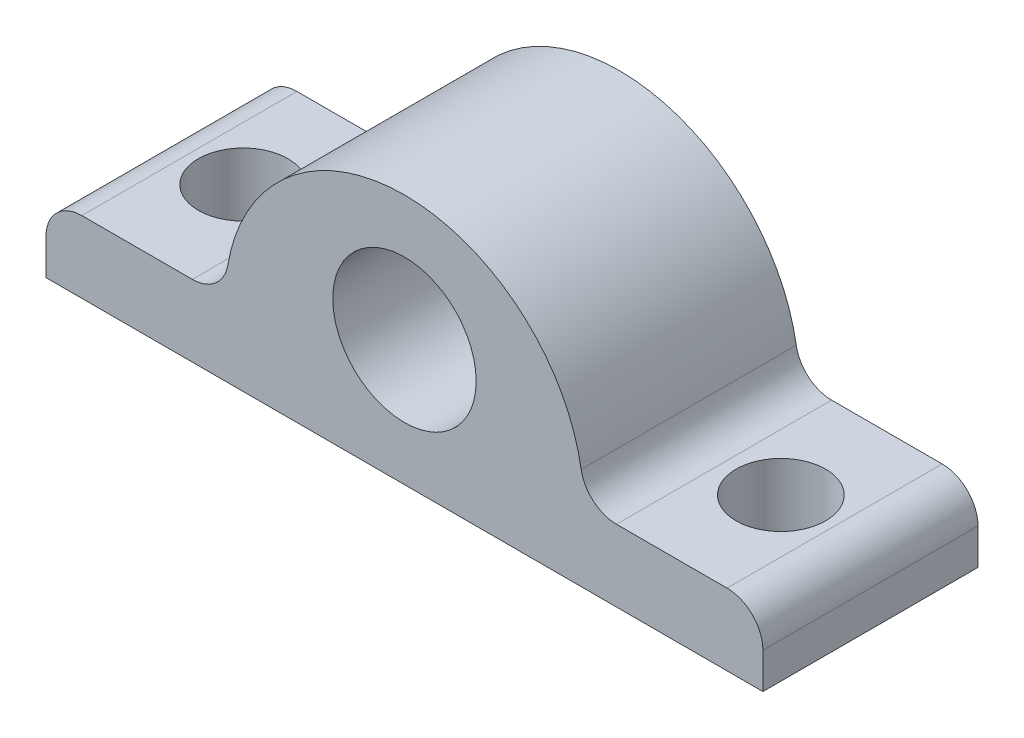
ISO-10303-21;
HEADER;
FILE_DESCRIPTION(('STEP AP214'),'2;1');
FILE_NAME('part.step','',(''),(''),'','','');
FILE_SCHEMA(('AUTOMOTIVE_DESIGN { 1 0 10303 214 1 1 1 1 }'));
ENDSEC;
DATA;
#1=APPLICATION_CONTEXT('core data for automotive mechanical design processes');
#2=APPLICATION_PROTOCOL_DEFINITION('international standard','automotive_design',2000,#1);
#3=PRODUCT_CONTEXT('',#1,'mechanical');
#4=PRODUCT('Part','Part','',(#3));
#5=PRODUCT_RELATED_PRODUCT_CATEGORY('part','',(#4));
#6=PRODUCT_DEFINITION_FORMATION('','',#4);
#7=PRODUCT_DEFINITION_CONTEXT('part definition',#1,'design');
#8=PRODUCT_DEFINITION('design','',#6,#7);
#9=PRODUCT_DEFINITION_SHAPE('','',#8);
#10=(LENGTH_UNIT() NAMED_UNIT(*) SI_UNIT(.MILLI.,.METRE.));
#11=(NAMED_UNIT(*) PLANE_ANGLE_UNIT() SI_UNIT($,.RADIAN.));
#12=(NAMED_UNIT(*) SI_UNIT($,.STERADIAN.) SOLID_ANGLE_UNIT());
#13=UNCERTAINTY_MEASURE_WITH_UNIT(LENGTH_MEASURE(1.E-05),#10,'distance_accuracy_value','');
#14=(GEOMETRIC_REPRESENTATION_CONTEXT(3) GLOBAL_UNCERTAINTY_ASSIGNED_CONTEXT((#13)) GLOBAL_UNIT_ASSIGNED_CONTEXT((#10,
#11,#12)) REPRESENTATION_CONTEXT('',''));
#15=CARTESIAN_POINT('',(0.,0.,0.));
#16=DIRECTION('',(0.,0.,1.));
#17=DIRECTION('',(1.,0.,0.));
#18=AXIS2_PLACEMENT_3D('',#15,#16,#17);
#19=CARTESIAN_POINT('',(0.,4.,0.));
#20=DIRECTION('',(0.,1.,0.));
#21=DIRECTION('',(0.,0.,1.));
#22=AXIS2_PLACEMENT_3D('',#19,#20,#21);
#23=PLANE('',#22);
#24=CARTESIAN_POINT('',(-15.,4.,0.));
#25=DIRECTION('',(0.,1.,0.));
#26=DIRECTION('',(0.,0.,1.));
#27=AXIS2_PLACEMENT_3D('',#24,#25,#26);
#28=CIRCLE('',#27,2.5);
#29=CARTESIAN_POINT('',(-15.,4.,2.5));
#30=VERTEX_POINT('',#29);
#31=EDGE_CURVE('E220',#30,#30,#28,.T.);
#32=ORIENTED_EDGE('',*,*,#31,.F.);
#33=EDGE_LOOP('',(#32));
#34=FACE_BOUND('',#33,.T.);
#35=DIRECTION('',(1.,0.,0.));
#36=VECTOR('',#35,1.);
#37=CARTESIAN_POINT('',(-20.,4.,6.));
#38=LINE('',#37,#36);
#39=CARTESIAN_POINT('',(-18.,4.,6.));
#40=VERTEX_POINT('',#39);
#41=CARTESIAN_POINT('',(-11.8321595661992,4.,6.));
#42=VERTEX_POINT('',#41);
#43=EDGE_CURVE('E138',#40,#42,#38,.T.);
#44=ORIENTED_EDGE('',*,*,#43,.T.);
#45=DIRECTION('',(0.,0.,-1.));
#46=VECTOR('',#45,1.);
#47=CARTESIAN_POINT('',(-11.8321595661992,4.,-6.));
#48=LINE('',#47,#46);
#49=CARTESIAN_POINT('',(-11.8321595661992,4.,-6.));
#50=VERTEX_POINT('',#49);
#51=EDGE_CURVE('E162',#42,#50,#48,.T.);
#52=ORIENTED_EDGE('',*,*,#51,.T.);
#53=DIRECTION('',(-1.,0.,0.));
#54=VECTOR('',#53,1.);
#55=CARTESIAN_POINT('',(-20.,4.,-6.));
#56=LINE('',#55,#54);
#57=CARTESIAN_POINT('',(-18.,4.,-6.));
#58=VERTEX_POINT('',#57);
#59=EDGE_CURVE('E144',#50,#58,#56,.T.);
#60=ORIENTED_EDGE('',*,*,#59,.T.);
#61=DIRECTION('',(0.,0.,1.));
#62=VECTOR('',#61,1.);
#63=CARTESIAN_POINT('',(-18.,4.,6.));
#64=LINE('',#63,#62);
#65=EDGE_CURVE('E159',#58,#40,#64,.T.);
#66=ORIENTED_EDGE('',*,*,#65,.T.);
#67=EDGE_LOOP('',(#44,#52,#60,#66));
#68=FACE_BOUND('',#67,.T.);
#69=ADVANCED_FACE('F33',(#34,#68),#23,.T.);
#70=CARTESIAN_POINT('',(20.,4.,-6.));
#71=DIRECTION('',(-1.,0.,0.));
#72=DIRECTION('',(0.,0.,1.));
#73=AXIS2_PLACEMENT_3D('',#70,#71,#72);
#74=PLANE('',#73);
#75=DIRECTION('',(0.,-1.,0.));
#76=VECTOR('',#75,1.);
#77=CARTESIAN_POINT('',(20.,4.,-6.));
#78=LINE('',#77,#76);
#79=CARTESIAN_POINT('',(20.,2.,-6.));
#80=VERTEX_POINT('',#79);
#81=CARTESIAN_POINT('',(20.,0.,-6.));
#82=VERTEX_POINT('',#81);
#83=EDGE_CURVE('E109',#80,#82,#78,.T.);
#84=ORIENTED_EDGE('',*,*,#83,.F.);
#85=DIRECTION('',(0.,0.,-1.));
#86=VECTOR('',#85,1.);
#87=CARTESIAN_POINT('',(20.,2.,6.));
#88=LINE('',#87,#86);
#89=CARTESIAN_POINT('',(20.,2.,6.));
#90=VERTEX_POINT('',#89);
#91=EDGE_CURVE('E56',#80,#90,#88,.F.);
#92=ORIENTED_EDGE('',*,*,#91,.T.);
#93=DIRECTION('',(0.,-1.,0.));
#94=VECTOR('',#93,1.);
#95=CARTESIAN_POINT('',(20.,4.,6.));
#96=LINE('',#95,#94);
#97=CARTESIAN_POINT('',(20.,0.,6.));
#98=VERTEX_POINT('',#97);
#99=EDGE_CURVE('E130',#90,#98,#96,.T.);
#100=ORIENTED_EDGE('',*,*,#99,.T.);
#101=DIRECTION('',(0.,0.,-1.));
#102=VECTOR('',#101,1.);
#103=CARTESIAN_POINT('',(20.,0.,-6.));
#104=LINE('',#103,#102);
#105=EDGE_CURVE('E125',#98,#82,#104,.T.);
#106=ORIENTED_EDGE('',*,*,#105,.T.);
#107=EDGE_LOOP('',(#84,#92,#100,#106));
#108=FACE_BOUND('',#107,.T.);
#109=ADVANCED_FACE('F129',(#108),#74,.F.);
#110=CARTESIAN_POINT('',(-20.,4.,-6.));
#111=DIRECTION('',(0.,0.,1.));
#112=DIRECTION('',(1.,0.,0.));
#113=AXIS2_PLACEMENT_3D('',#110,#111,#112);
#114=PLANE('',#113);
#115=CARTESIAN_POINT('',(0.,7.,-6.));
#116=DIRECTION('',(0.,0.,1.));
#117=DIRECTION('',(1.,0.,0.));
#118=AXIS2_PLACEMENT_3D('',#115,#116,#117);
#119=CIRCLE('',#118,4.);
#120=CARTESIAN_POINT('',(4.,7.,-6.));
#121=VERTEX_POINT('',#120);
#122=EDGE_CURVE('E206',#121,#121,#119,.T.);
#123=ORIENTED_EDGE('',*,*,#122,.T.);
#124=EDGE_LOOP('',(#123));
#125=FACE_BOUND('',#124,.T.);
#126=CARTESIAN_POINT('',(18.,4.,-6.));
#127=VERTEX_POINT('',#126);
#128=CARTESIAN_POINT('',(11.8321595661992,4.,-6.));
#129=VERTEX_POINT('',#128);
#130=EDGE_CURVE('E199',#127,#129,#56,.T.);
#131=ORIENTED_EDGE('',*,*,#130,.F.);
#132=CARTESIAN_POINT('',(18.,2.,-6.));
#133=DIRECTION('',(0.,0.,1.));
#134=DIRECTION('',(1.,0.,0.));
#135=AXIS2_PLACEMENT_3D('',#132,#133,#134);
#136=CIRCLE('',#135,2.);
#137=EDGE_CURVE('E116',#127,#80,#136,.F.);
#138=ORIENTED_EDGE('',*,*,#137,.T.);
#139=ORIENTED_EDGE('',*,*,#83,.T.);
#140=DIRECTION('',(-1.,0.,0.));
#141=VECTOR('',#140,1.);
#142=CARTESIAN_POINT('',(-20.,0.,-6.));
#143=LINE('',#142,#141);
#144=CARTESIAN_POINT('',(-20.,0.,-6.));
#145=VERTEX_POINT('',#144);
#146=EDGE_CURVE('E114',#82,#145,#143,.T.);
#147=ORIENTED_EDGE('',*,*,#146,.T.);
#148=DIRECTION('',(0.,-1.,0.));
#149=VECTOR('',#148,1.);
#150=CARTESIAN_POINT('',(-20.,4.,-6.));
#151=LINE('',#150,#149);
#152=CARTESIAN_POINT('',(-20.,2.,-6.));
#153=VERTEX_POINT('',#152);
#154=EDGE_CURVE('E119',#153,#145,#151,.T.);
#155=ORIENTED_EDGE('',*,*,#154,.F.);
#156=CARTESIAN_POINT('',(-18.,2.,-6.));
#157=DIRECTION('',(0.,0.,1.));
#158=DIRECTION('',(1.,0.,0.));
#159=AXIS2_PLACEMENT_3D('',#156,#157,#158);
#160=CIRCLE('',#159,2.);
#161=EDGE_CURVE('E164',#153,#58,#160,.F.);
#162=ORIENTED_EDGE('',*,*,#161,.T.);
#163=ORIENTED_EDGE('',*,*,#59,.F.);
#164=CARTESIAN_POINT('',(-11.8321595661992,6.,-6.));
#165=DIRECTION('',(0.,0.,1.));
#166=DIRECTION('',(1.,0.,0.));
#167=AXIS2_PLACEMENT_3D('',#164,#165,#166);
#168=CIRCLE('',#167,2.);
#169=CARTESIAN_POINT('',(-9.86013297183269,5.66666666666667,-6.));
#170=VERTEX_POINT('',#169);
#171=EDGE_CURVE('E11',#50,#170,#168,.T.);
#172=ORIENTED_EDGE('',*,*,#171,.T.);
#173=CARTESIAN_POINT('',(0.,4.,-6.));
#174=DIRECTION('',(0.,0.,1.));
#175=DIRECTION('',(1.,0.,0.));
#176=AXIS2_PLACEMENT_3D('',#173,#174,#175);
#177=CIRCLE('',#176,10.);
#178=CARTESIAN_POINT('',(9.86013297183269,5.66666666666667,-6.));
#179=VERTEX_POINT('',#178);
#180=EDGE_CURVE('E132',#170,#179,#177,.F.);
#181=ORIENTED_EDGE('',*,*,#180,.T.);
#182=CARTESIAN_POINT('',(11.8321595661992,6.,-6.));
#183=DIRECTION('',(0.,0.,1.));
#184=DIRECTION('',(1.,0.,0.));
#185=AXIS2_PLACEMENT_3D('',#182,#183,#184);
#186=CIRCLE('',#185,2.);
#187=EDGE_CURVE('E175',#179,#129,#186,.T.);
#188=ORIENTED_EDGE('',*,*,#187,.T.);
#189=EDGE_LOOP('',(#131,#138,#139,#147,#155,#162,#163,#172,#181,#188));
#190=FACE_BOUND('',#189,.T.);
#191=ADVANCED_FACE('F112',(#125,#190),#114,.F.);
#192=CARTESIAN_POINT('',(-20.,4.,-6.));
#193=DIRECTION('',(1.,0.,0.));
#194=DIRECTION('',(0.,0.,-1.));
#195=AXIS2_PLACEMENT_3D('',#192,#193,#194);
#196=PLANE('',#195);
#197=DIRECTION('',(0.,-1.,0.));
#198=VECTOR('',#197,1.);
#199=CARTESIAN_POINT('',(-20.,4.,6.));
#200=LINE('',#199,#198);
#201=CARTESIAN_POINT('',(-20.,2.,6.));
#202=VERTEX_POINT('',#201);
#203=CARTESIAN_POINT('',(-20.,0.,6.));
#204=VERTEX_POINT('',#203);
#205=EDGE_CURVE('E146',#202,#204,#200,.T.);
#206=ORIENTED_EDGE('',*,*,#205,.F.);
#207=DIRECTION('',(0.,0.,1.));
#208=VECTOR('',#207,1.);
#209=CARTESIAN_POINT('',(-20.,2.,-6.));
#210=LINE('',#209,#208);
#211=EDGE_CURVE('E171',#202,#153,#210,.F.);
#212=ORIENTED_EDGE('',*,*,#211,.T.);
#213=ORIENTED_EDGE('',*,*,#154,.T.);
#214=DIRECTION('',(0.,0.,1.));
#215=VECTOR('',#214,1.);
#216=CARTESIAN_POINT('',(-20.,0.,-6.));
#217=LINE('',#216,#215);
#218=EDGE_CURVE('E127',#145,#204,#217,.T.);
#219=ORIENTED_EDGE('',*,*,#218,.T.);
#220=EDGE_LOOP('',(#206,#212,#213,#219));
#221=FACE_BOUND('',#220,.T.);
#222=ADVANCED_FACE('F249',(#221),#196,.F.);
#223=CARTESIAN_POINT('',(-20.,4.,6.));
#224=DIRECTION('',(0.,0.,-1.));
#225=DIRECTION('',(-1.,0.,0.));
#226=AXIS2_PLACEMENT_3D('',#223,#224,#225);
#227=PLANE('',#226);
#228=CARTESIAN_POINT('',(0.,7.,6.));
#229=DIRECTION('',(0.,0.,1.));
#230=DIRECTION('',(1.,0.,0.));
#231=AXIS2_PLACEMENT_3D('',#228,#229,#230);
#232=CIRCLE('',#231,4.);
#233=CARTESIAN_POINT('',(4.,7.,6.));
#234=VERTEX_POINT('',#233);
#235=EDGE_CURVE('E208',#234,#234,#232,.T.);
#236=ORIENTED_EDGE('',*,*,#235,.F.);
#237=EDGE_LOOP('',(#236));
#238=FACE_BOUND('',#237,.T.);
#239=ORIENTED_EDGE('',*,*,#99,.F.);
#240=CARTESIAN_POINT('',(18.,2.,6.));
#241=DIRECTION('',(0.,0.,-1.));
#242=DIRECTION('',(-1.,0.,0.));
#243=AXIS2_PLACEMENT_3D('',#240,#241,#242);
#244=CIRCLE('',#243,2.);
#245=CARTESIAN_POINT('',(18.,4.,6.));
#246=VERTEX_POINT('',#245);
#247=EDGE_CURVE('E169',#90,#246,#244,.F.);
#248=ORIENTED_EDGE('',*,*,#247,.T.);
#249=CARTESIAN_POINT('',(11.8321595661992,4.,6.));
#250=VERTEX_POINT('',#249);
#251=EDGE_CURVE('E187',#250,#246,#38,.T.);
#252=ORIENTED_EDGE('',*,*,#251,.F.);
#253=CARTESIAN_POINT('',(11.8321595661992,6.,6.));
#254=DIRECTION('',(0.,0.,-1.));
#255=DIRECTION('',(-1.,0.,0.));
#256=AXIS2_PLACEMENT_3D('',#253,#254,#255);
#257=CIRCLE('',#256,2.);
#258=CARTESIAN_POINT('',(9.86013297183269,5.66666666666667,6.));
#259=VERTEX_POINT('',#258);
#260=EDGE_CURVE('E173',#250,#259,#257,.T.);
#261=ORIENTED_EDGE('',*,*,#260,.T.);
#262=CARTESIAN_POINT('',(0.,4.,6.));
#263=DIRECTION('',(0.,0.,1.));
#264=DIRECTION('',(-1.,0.,0.));
#265=AXIS2_PLACEMENT_3D('',#262,#263,#264);
#266=CIRCLE('',#265,10.);
#267=CARTESIAN_POINT('',(-9.86013297183269,5.66666666666667,6.));
#268=VERTEX_POINT('',#267);
#269=EDGE_CURVE('E135',#259,#268,#266,.T.);
#270=ORIENTED_EDGE('',*,*,#269,.T.);
#271=CARTESIAN_POINT('',(-11.8321595661992,6.,6.));
#272=DIRECTION('',(0.,0.,-1.));
#273=DIRECTION('',(-1.,0.,0.));
#274=AXIS2_PLACEMENT_3D('',#271,#272,#273);
#275=CIRCLE('',#274,2.);
#276=EDGE_CURVE('E41',#268,#42,#275,.T.);
#277=ORIENTED_EDGE('',*,*,#276,.T.);
#278=ORIENTED_EDGE('',*,*,#43,.F.);
#279=CARTESIAN_POINT('',(-18.,2.,6.));
#280=DIRECTION('',(0.,0.,-1.));
#281=DIRECTION('',(-1.,0.,0.));
#282=AXIS2_PLACEMENT_3D('',#279,#280,#281);
#283=CIRCLE('',#282,2.);
#284=EDGE_CURVE('E48',#40,#202,#283,.F.);
#285=ORIENTED_EDGE('',*,*,#284,.T.);
#286=ORIENTED_EDGE('',*,*,#205,.T.);
#287=DIRECTION('',(1.,0.,0.));
#288=VECTOR('',#287,1.);
#289=CARTESIAN_POINT('',(-20.,0.,6.));
#290=LINE('',#289,#288);
#291=EDGE_CURVE('E142',#204,#98,#290,.T.);
#292=ORIENTED_EDGE('',*,*,#291,.T.);
#293=EDGE_LOOP('',(#239,#248,#252,#261,#270,#277,#278,#285,#286,#292));
#294=FACE_BOUND('',#293,.T.);
#295=ADVANCED_FACE('F178',(#238,#294),#227,.F.);
#296=CARTESIAN_POINT('',(15.,4.,0.));
#297=DIRECTION('',(0.,1.,0.));
#298=DIRECTION('',(0.,0.,1.));
#299=AXIS2_PLACEMENT_3D('',#296,#297,#298);
#300=CIRCLE('',#299,2.5);
#301=CARTESIAN_POINT('',(15.,4.,2.5));
#302=VERTEX_POINT('',#301);
#303=EDGE_CURVE('E214',#302,#302,#300,.T.);
#304=ORIENTED_EDGE('',*,*,#303,.F.);
#305=EDGE_LOOP('',(#304));
#306=FACE_BOUND('',#305,.T.);
#307=ORIENTED_EDGE('',*,*,#130,.T.);
#308=DIRECTION('',(0.,0.,-1.));
#309=VECTOR('',#308,1.);
#310=CARTESIAN_POINT('',(11.8321595661992,4.,6.));
#311=LINE('',#310,#309);
#312=EDGE_CURVE('E151',#129,#250,#311,.F.);
#313=ORIENTED_EDGE('',*,*,#312,.T.);
#314=ORIENTED_EDGE('',*,*,#251,.T.);
#315=DIRECTION('',(0.,0.,-1.));
#316=VECTOR('',#315,1.);
#317=CARTESIAN_POINT('',(18.,4.,-6.));
#318=LINE('',#317,#316);
#319=EDGE_CURVE('E118',#246,#127,#318,.T.);
#320=ORIENTED_EDGE('',*,*,#319,.T.);
#321=EDGE_LOOP('',(#307,#313,#314,#320));
#322=FACE_BOUND('',#321,.T.);
#323=ADVANCED_FACE('F201',(#306,#322),#23,.T.);
#324=CARTESIAN_POINT('',(0.,0.,0.));
#325=DIRECTION('',(0.,1.,0.));
#326=DIRECTION('',(0.,0.,1.));
#327=AXIS2_PLACEMENT_3D('',#324,#325,#326);
#328=PLANE('',#327);
#329=CARTESIAN_POINT('',(-15.,0.,0.));
#330=DIRECTION('',(0.,1.,0.));
#331=DIRECTION('',(0.,0.,1.));
#332=AXIS2_PLACEMENT_3D('',#329,#330,#331);
#333=CIRCLE('',#332,2.5);
#334=CARTESIAN_POINT('',(-15.,0.,2.5));
#335=VERTEX_POINT('',#334);
#336=EDGE_CURVE('E211',#335,#335,#333,.T.);
#337=ORIENTED_EDGE('',*,*,#336,.T.);
#338=EDGE_LOOP('',(#337));
#339=FACE_BOUND('',#338,.T.);
#340=CARTESIAN_POINT('',(15.,0.,0.));
#341=DIRECTION('',(0.,1.,0.));
#342=DIRECTION('',(0.,0.,1.));
#343=AXIS2_PLACEMENT_3D('',#340,#341,#342);
#344=CIRCLE('',#343,2.5);
#345=CARTESIAN_POINT('',(15.,0.,2.5));
#346=VERTEX_POINT('',#345);
#347=EDGE_CURVE('E217',#346,#346,#344,.T.);
#348=ORIENTED_EDGE('',*,*,#347,.T.);
#349=EDGE_LOOP('',(#348));
#350=FACE_BOUND('',#349,.T.);
#351=ORIENTED_EDGE('',*,*,#105,.F.);
#352=ORIENTED_EDGE('',*,*,#291,.F.);
#353=ORIENTED_EDGE('',*,*,#218,.F.);
#354=ORIENTED_EDGE('',*,*,#146,.F.);
#355=EDGE_LOOP('',(#351,#352,#353,#354));
#356=FACE_BOUND('',#355,.T.);
#357=ADVANCED_FACE('F123',(#339,#350,#356),#328,.F.);
#358=CARTESIAN_POINT('',(0.,4.,-48.3792402008342));
#359=DIRECTION('',(0.,0.,1.));
#360=DIRECTION('',(1.,0.,0.));
#361=AXIS2_PLACEMENT_3D('',#358,#359,#360);
#362=CYLINDRICAL_SURFACE('',#361,10.);
#363=ORIENTED_EDGE('',*,*,#269,.F.);
#364=DIRECTION('',(0.,0.,1.));
#365=VECTOR('',#364,1.);
#366=CARTESIAN_POINT('',(9.8601329718327,5.66666666666667,-48.3792402008342));
#367=LINE('',#366,#365);
#368=EDGE_CURVE('E157',#259,#179,#367,.F.);
#369=ORIENTED_EDGE('',*,*,#368,.T.);
#370=ORIENTED_EDGE('',*,*,#180,.F.);
#371=DIRECTION('',(0.,0.,1.));
#372=VECTOR('',#371,1.);
#373=CARTESIAN_POINT('',(-9.8601329718327,5.66666666666667,-48.3792402008342));
#374=LINE('',#373,#372);
#375=EDGE_CURVE('E154',#170,#268,#374,.T.);
#376=ORIENTED_EDGE('',*,*,#375,.T.);
#377=EDGE_LOOP('',(#363,#369,#370,#376));
#378=FACE_BOUND('',#377,.T.);
#379=ADVANCED_FACE('F193',(#378),#362,.T.);
#380=CARTESIAN_POINT('',(0.,7.,-6.));
#381=DIRECTION('',(0.,0.,1.));
#382=DIRECTION('',(1.,0.,0.));
#383=AXIS2_PLACEMENT_3D('',#380,#381,#382);
#384=CYLINDRICAL_SURFACE('',#383,4.);
#385=ORIENTED_EDGE('',*,*,#122,.F.);
#386=EDGE_LOOP('',(#385));
#387=FACE_BOUND('',#386,.T.);
#388=ORIENTED_EDGE('',*,*,#235,.T.);
#389=EDGE_LOOP('',(#388));
#390=FACE_BOUND('',#389,.T.);
#391=ADVANCED_FACE('F255',(#387,#390),#384,.F.);
#392=CARTESIAN_POINT('',(15.,0.,0.));
#393=DIRECTION('',(0.,1.,0.));
#394=DIRECTION('',(0.,0.,1.));
#395=AXIS2_PLACEMENT_3D('',#392,#393,#394);
#396=CYLINDRICAL_SURFACE('',#395,2.5);
#397=ORIENTED_EDGE('',*,*,#347,.F.);
#398=EDGE_LOOP('',(#397));
#399=FACE_BOUND('',#398,.T.);
#400=ORIENTED_EDGE('',*,*,#303,.T.);
#401=EDGE_LOOP('',(#400));
#402=FACE_BOUND('',#401,.T.);
#403=ADVANCED_FACE('F231',(#399,#402),#396,.F.);
#404=CARTESIAN_POINT('',(-15.,0.,0.));
#405=DIRECTION('',(0.,1.,0.));
#406=DIRECTION('',(0.,0.,1.));
#407=AXIS2_PLACEMENT_3D('',#404,#405,#406);
#408=CYLINDRICAL_SURFACE('',#407,2.5);
#409=ORIENTED_EDGE('',*,*,#336,.F.);
#410=EDGE_LOOP('',(#409));
#411=FACE_BOUND('',#410,.T.);
#412=ORIENTED_EDGE('',*,*,#31,.T.);
#413=EDGE_LOOP('',(#412));
#414=FACE_BOUND('',#413,.T.);
#415=ADVANCED_FACE('F228',(#411,#414),#408,.F.);
#416=CARTESIAN_POINT('',(11.8321595661992,6.,-48.3792402008342));
#417=DIRECTION('',(0.,0.,1.));
#418=DIRECTION('',(1.,0.,0.));
#419=AXIS2_PLACEMENT_3D('',#416,#417,#418);
#420=CYLINDRICAL_SURFACE('',#419,2.);
#421=ORIENTED_EDGE('',*,*,#187,.F.);
#422=ORIENTED_EDGE('',*,*,#368,.F.);
#423=ORIENTED_EDGE('',*,*,#260,.F.);
#424=ORIENTED_EDGE('',*,*,#312,.F.);
#425=EDGE_LOOP('',(#421,#422,#423,#424));
#426=FACE_BOUND('',#425,.T.);
#427=ADVANCED_FACE('F196',(#426),#420,.F.);
#428=CARTESIAN_POINT('',(-11.8321595661992,6.,-48.3792402008342));
#429=DIRECTION('',(0.,0.,1.));
#430=DIRECTION('',(1.,0.,0.));
#431=AXIS2_PLACEMENT_3D('',#428,#429,#430);
#432=CYLINDRICAL_SURFACE('',#431,2.);
#433=ORIENTED_EDGE('',*,*,#171,.F.);
#434=ORIENTED_EDGE('',*,*,#51,.F.);
#435=ORIENTED_EDGE('',*,*,#276,.F.);
#436=ORIENTED_EDGE('',*,*,#375,.F.);
#437=EDGE_LOOP('',(#433,#434,#435,#436));
#438=FACE_BOUND('',#437,.T.);
#439=ADVANCED_FACE('F189',(#438),#432,.F.);
#440=CARTESIAN_POINT('',(18.,2.,0.));
#441=DIRECTION('',(0.,0.,1.));
#442=DIRECTION('',(1.,0.,0.));
#443=AXIS2_PLACEMENT_3D('',#440,#441,#442);
#444=CYLINDRICAL_SURFACE('',#443,2.);
#445=ORIENTED_EDGE('',*,*,#247,.F.);
#446=ORIENTED_EDGE('',*,*,#91,.F.);
#447=ORIENTED_EDGE('',*,*,#137,.F.);
#448=ORIENTED_EDGE('',*,*,#319,.F.);
#449=EDGE_LOOP('',(#445,#446,#447,#448));
#450=FACE_BOUND('',#449,.T.);
#451=ADVANCED_FACE('F343',(#450),#444,.T.);
#452=CARTESIAN_POINT('',(-18.,2.,0.));
#453=DIRECTION('',(0.,0.,-1.));
#454=DIRECTION('',(-1.,0.,0.));
#455=AXIS2_PLACEMENT_3D('',#452,#453,#454);
#456=CYLINDRICAL_SURFACE('',#455,2.);
#457=ORIENTED_EDGE('',*,*,#161,.F.);
#458=ORIENTED_EDGE('',*,*,#211,.F.);
#459=ORIENTED_EDGE('',*,*,#284,.F.);
#460=ORIENTED_EDGE('',*,*,#65,.F.);
#461=EDGE_LOOP('',(#457,#458,#459,#460));
#462=FACE_BOUND('',#461,.T.);
#463=ADVANCED_FACE('F35',(#462),#456,.T.);
#464=CLOSED_SHELL('',(#69,#109,#191,#222,#295,#323,#357,#379,#391,#403,#415,#427,#439,#451,#463));
#465=MANIFOLD_SOLID_BREP('B2',#464);
#466=ADVANCED_BREP_SHAPE_REPRESENTATION('',(#18,#465),#14);
#467=SHAPE_DEFINITION_REPRESENTATION(#9,#466);
ENDSEC;
END-ISO-10303-21;
